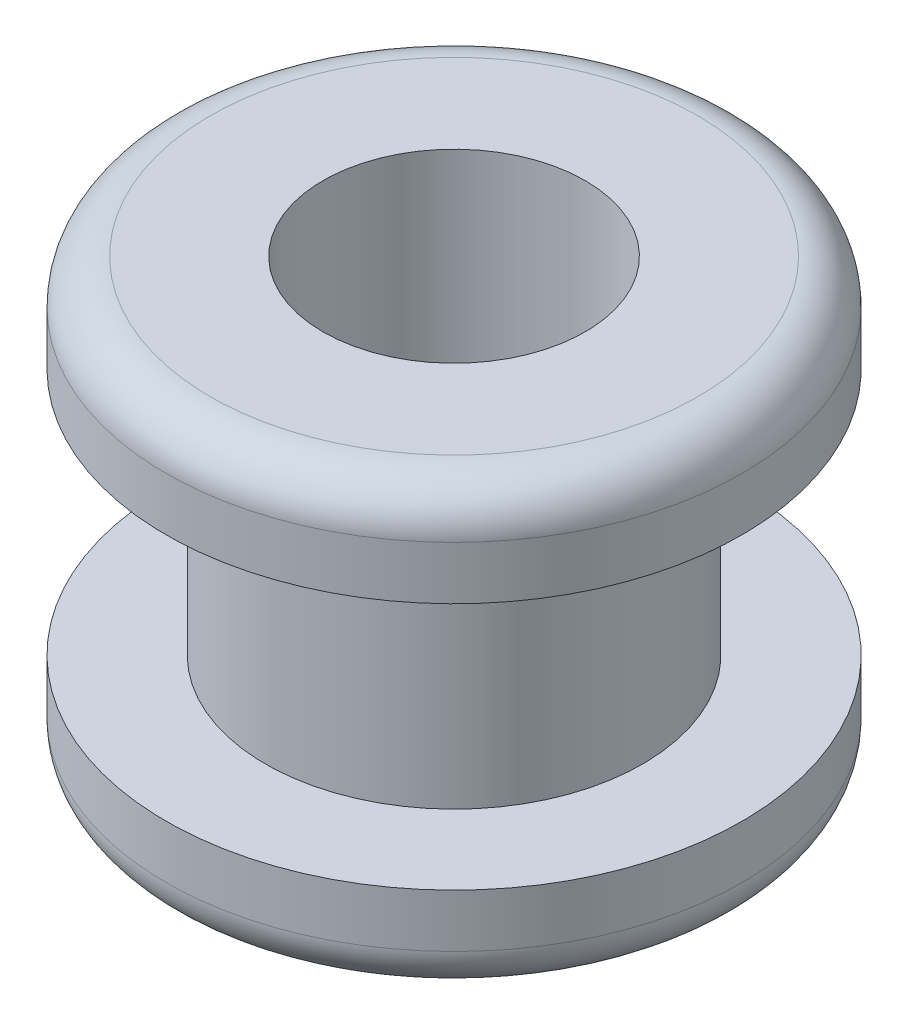
ISO-10303-21;
HEADER;
FILE_DESCRIPTION(('STEP AP214'),'2;1');
FILE_NAME('part.step','',(''),(''),'','','');
FILE_SCHEMA(('AUTOMOTIVE_DESIGN { 1 0 10303 214 1 1 1 1 }'));
ENDSEC;
DATA;
#1=APPLICATION_CONTEXT('core data for automotive mechanical design processes');
#2=APPLICATION_PROTOCOL_DEFINITION('international standard','automotive_design',2000,#1);
#3=PRODUCT_CONTEXT('',#1,'mechanical');
#4=PRODUCT('Part','Part','',(#3));
#5=PRODUCT_RELATED_PRODUCT_CATEGORY('part','',(#4));
#6=PRODUCT_DEFINITION_FORMATION('','',#4);
#7=PRODUCT_DEFINITION_CONTEXT('part definition',#1,'design');
#8=PRODUCT_DEFINITION('design','',#6,#7);
#9=PRODUCT_DEFINITION_SHAPE('','',#8);
#10=(LENGTH_UNIT() NAMED_UNIT(*) SI_UNIT(.MILLI.,.METRE.));
#11=(NAMED_UNIT(*) PLANE_ANGLE_UNIT() SI_UNIT($,.RADIAN.));
#12=(NAMED_UNIT(*) SI_UNIT($,.STERADIAN.) SOLID_ANGLE_UNIT());
#13=UNCERTAINTY_MEASURE_WITH_UNIT(LENGTH_MEASURE(1.E-05),#10,'distance_accuracy_value','');
#14=(GEOMETRIC_REPRESENTATION_CONTEXT(3) GLOBAL_UNCERTAINTY_ASSIGNED_CONTEXT((#13)) GLOBAL_UNIT_ASSIGNED_CONTEXT((#10,
#11,#12)) REPRESENTATION_CONTEXT('',''));
#15=CARTESIAN_POINT('',(0.,0.,0.));
#16=DIRECTION('',(0.,0.,1.));
#17=DIRECTION('',(1.,0.,0.));
#18=AXIS2_PLACEMENT_3D('',#15,#16,#17);
#19=CARTESIAN_POINT('',(0.,0.,0.));
#20=DIRECTION('',(0.,-1.,0.));
#21=DIRECTION('',(0.,0.,-1.));
#22=AXIS2_PLACEMENT_3D('',#19,#20,#21);
#23=CYLINDRICAL_SURFACE('',#22,1.48);
#24=CARTESIAN_POINT('',(0.,2.5,0.));
#25=DIRECTION('',(0.,-1.,0.));
#26=DIRECTION('',(0.,0.,-1.));
#27=AXIS2_PLACEMENT_3D('',#24,#25,#26);
#28=CIRCLE('',#27,1.48);
#29=CARTESIAN_POINT('',(0.,2.5,-1.48));
#30=VERTEX_POINT('',#29);
#31=EDGE_CURVE('E10',#30,#30,#28,.T.);
#32=ORIENTED_EDGE('',*,*,#31,.F.);
#33=EDGE_LOOP('',(#32));
#34=FACE_BOUND('',#33,.T.);
#35=CARTESIAN_POINT('',(0.,-2.5,0.));
#36=DIRECTION('',(0.,-1.,0.));
#37=DIRECTION('',(0.,0.,-1.));
#38=AXIS2_PLACEMENT_3D('',#35,#36,#37);
#39=CIRCLE('',#38,1.48);
#40=CARTESIAN_POINT('',(0.,-2.5,-1.48));
#41=VERTEX_POINT('',#40);
#42=EDGE_CURVE('E71',#41,#41,#39,.T.);
#43=ORIENTED_EDGE('',*,*,#42,.T.);
#44=EDGE_LOOP('',(#43));
#45=FACE_BOUND('',#44,.T.);
#46=ADVANCED_FACE('F37',(#34,#45),#23,.F.);
#47=CARTESIAN_POINT('',(-2.75,2.5,0.));
#48=DIRECTION('',(0.,-1.,0.));
#49=DIRECTION('',(0.,0.,-1.));
#50=AXIS2_PLACEMENT_3D('',#47,#48,#49);
#51=PLANE('',#50);
#52=CARTESIAN_POINT('',(0.,2.5,0.));
#53=DIRECTION('',(0.,-1.,0.));
#54=DIRECTION('',(0.,0.,-1.));
#55=AXIS2_PLACEMENT_3D('',#52,#53,#54);
#56=CIRCLE('',#55,2.75);
#57=CARTESIAN_POINT('',(0.,2.5,-2.75));
#58=VERTEX_POINT('',#57);
#59=EDGE_CURVE('E43',#58,#58,#56,.T.);
#60=ORIENTED_EDGE('',*,*,#59,.F.);
#61=EDGE_LOOP('',(#60));
#62=FACE_BOUND('',#61,.T.);
#63=ORIENTED_EDGE('',*,*,#31,.T.);
#64=EDGE_LOOP('',(#63));
#65=FACE_BOUND('',#64,.T.);
#66=ADVANCED_FACE('F120',(#62,#65),#51,.F.);
#67=CARTESIAN_POINT('',(0.,2.,0.));
#68=DIRECTION('',(0.,-1.,0.));
#69=DIRECTION('',(0.,0.,-1.));
#70=AXIS2_PLACEMENT_3D('',#67,#68,#69);
#71=TOROIDAL_SURFACE('',#70,2.75,0.5);
#72=CARTESIAN_POINT('',(0.,2.,0.));
#73=DIRECTION('',(0.,-1.,0.));
#74=DIRECTION('',(0.,0.,-1.));
#75=AXIS2_PLACEMENT_3D('',#72,#73,#74);
#76=CIRCLE('',#75,3.25);
#77=CARTESIAN_POINT('',(0.,2.,-3.25));
#78=VERTEX_POINT('',#77);
#79=EDGE_CURVE('E47',#78,#78,#76,.T.);
#80=ORIENTED_EDGE('',*,*,#79,.F.);
#81=EDGE_LOOP('',(#80));
#82=FACE_BOUND('',#81,.T.);
#83=ORIENTED_EDGE('',*,*,#59,.T.);
#84=EDGE_LOOP('',(#83));
#85=FACE_BOUND('',#84,.T.);
#86=ADVANCED_FACE('F115',(#82,#85),#71,.T.);
#87=CARTESIAN_POINT('',(0.,0.,0.));
#88=DIRECTION('',(0.,-1.,0.));
#89=DIRECTION('',(0.,0.,-1.));
#90=AXIS2_PLACEMENT_3D('',#87,#88,#89);
#91=CYLINDRICAL_SURFACE('',#90,3.25);
#92=CARTESIAN_POINT('',(0.,1.4,0.));
#93=DIRECTION('',(0.,-1.,0.));
#94=DIRECTION('',(0.,0.,-1.));
#95=AXIS2_PLACEMENT_3D('',#92,#93,#94);
#96=CIRCLE('',#95,3.25);
#97=CARTESIAN_POINT('',(0.,1.4,-3.25));
#98=VERTEX_POINT('',#97);
#99=EDGE_CURVE('E51',#98,#98,#96,.T.);
#100=ORIENTED_EDGE('',*,*,#99,.F.);
#101=EDGE_LOOP('',(#100));
#102=FACE_BOUND('',#101,.T.);
#103=ORIENTED_EDGE('',*,*,#79,.T.);
#104=EDGE_LOOP('',(#103));
#105=FACE_BOUND('',#104,.T.);
#106=ADVANCED_FACE('F109',(#102,#105),#91,.T.);
#107=CARTESIAN_POINT('',(-3.25,1.4,0.));
#108=DIRECTION('',(0.,1.,0.));
#109=DIRECTION('',(0.,0.,1.));
#110=AXIS2_PLACEMENT_3D('',#107,#108,#109);
#111=PLANE('',#110);
#112=CARTESIAN_POINT('',(0.,1.4,0.));
#113=DIRECTION('',(0.,-1.,0.));
#114=DIRECTION('',(0.,0.,-1.));
#115=AXIS2_PLACEMENT_3D('',#112,#113,#114);
#116=CIRCLE('',#115,2.13);
#117=CARTESIAN_POINT('',(0.,1.4,-2.13));
#118=VERTEX_POINT('',#117);
#119=EDGE_CURVE('E56',#118,#118,#116,.T.);
#120=ORIENTED_EDGE('',*,*,#119,.F.);
#121=EDGE_LOOP('',(#120));
#122=FACE_BOUND('',#121,.T.);
#123=ORIENTED_EDGE('',*,*,#99,.T.);
#124=EDGE_LOOP('',(#123));
#125=FACE_BOUND('',#124,.T.);
#126=ADVANCED_FACE('F103',(#122,#125),#111,.F.);
#127=CARTESIAN_POINT('',(0.,0.,0.));
#128=DIRECTION('',(0.,-1.,0.));
#129=DIRECTION('',(0.,0.,-1.));
#130=AXIS2_PLACEMENT_3D('',#127,#128,#129);
#131=CYLINDRICAL_SURFACE('',#130,2.13);
#132=CARTESIAN_POINT('',(0.,-1.4,0.));
#133=DIRECTION('',(0.,-1.,0.));
#134=DIRECTION('',(0.,0.,-1.));
#135=AXIS2_PLACEMENT_3D('',#132,#133,#134);
#136=CIRCLE('',#135,2.13);
#137=CARTESIAN_POINT('',(0.,-1.4,-2.13));
#138=VERTEX_POINT('',#137);
#139=EDGE_CURVE('E59',#138,#138,#136,.T.);
#140=ORIENTED_EDGE('',*,*,#139,.F.);
#141=EDGE_LOOP('',(#140));
#142=FACE_BOUND('',#141,.T.);
#143=ORIENTED_EDGE('',*,*,#119,.T.);
#144=EDGE_LOOP('',(#143));
#145=FACE_BOUND('',#144,.T.);
#146=ADVANCED_FACE('F97',(#142,#145),#131,.T.);
#147=CARTESIAN_POINT('',(-3.25,-1.4,0.));
#148=DIRECTION('',(0.,-1.,0.));
#149=DIRECTION('',(0.,0.,-1.));
#150=AXIS2_PLACEMENT_3D('',#147,#148,#149);
#151=PLANE('',#150);
#152=CARTESIAN_POINT('',(0.,-1.4,0.));
#153=DIRECTION('',(0.,-1.,0.));
#154=DIRECTION('',(0.,0.,-1.));
#155=AXIS2_PLACEMENT_3D('',#152,#153,#154);
#156=CIRCLE('',#155,3.25);
#157=CARTESIAN_POINT('',(0.,-1.4,-3.25));
#158=VERTEX_POINT('',#157);
#159=EDGE_CURVE('E62',#158,#158,#156,.T.);
#160=ORIENTED_EDGE('',*,*,#159,.F.);
#161=EDGE_LOOP('',(#160));
#162=FACE_BOUND('',#161,.T.);
#163=ORIENTED_EDGE('',*,*,#139,.T.);
#164=EDGE_LOOP('',(#163));
#165=FACE_BOUND('',#164,.T.);
#166=ADVANCED_FACE('F91',(#162,#165),#151,.F.);
#167=CARTESIAN_POINT('',(0.,0.,0.));
#168=DIRECTION('',(0.,-1.,0.));
#169=DIRECTION('',(0.,0.,-1.));
#170=AXIS2_PLACEMENT_3D('',#167,#168,#169);
#171=CYLINDRICAL_SURFACE('',#170,3.25);
#172=CARTESIAN_POINT('',(0.,-2.,0.));
#173=DIRECTION('',(0.,-1.,0.));
#174=DIRECTION('',(0.,0.,-1.));
#175=AXIS2_PLACEMENT_3D('',#172,#173,#174);
#176=CIRCLE('',#175,3.25);
#177=CARTESIAN_POINT('',(0.,-2.,-3.25));
#178=VERTEX_POINT('',#177);
#179=EDGE_CURVE('E65',#178,#178,#176,.T.);
#180=ORIENTED_EDGE('',*,*,#179,.F.);
#181=EDGE_LOOP('',(#180));
#182=FACE_BOUND('',#181,.T.);
#183=ORIENTED_EDGE('',*,*,#159,.T.);
#184=EDGE_LOOP('',(#183));
#185=FACE_BOUND('',#184,.T.);
#186=ADVANCED_FACE('F85',(#182,#185),#171,.T.);
#187=CARTESIAN_POINT('',(0.,-2.,0.));
#188=DIRECTION('',(0.,-1.,0.));
#189=DIRECTION('',(0.,0.,-1.));
#190=AXIS2_PLACEMENT_3D('',#187,#188,#189);
#191=TOROIDAL_SURFACE('',#190,2.75,0.5);
#192=CARTESIAN_POINT('',(0.,-2.5,0.));
#193=DIRECTION('',(0.,-1.,0.));
#194=DIRECTION('',(0.,0.,-1.));
#195=AXIS2_PLACEMENT_3D('',#192,#193,#194);
#196=CIRCLE('',#195,2.75);
#197=CARTESIAN_POINT('',(0.,-2.5,-2.75));
#198=VERTEX_POINT('',#197);
#199=EDGE_CURVE('E68',#198,#198,#196,.T.);
#200=ORIENTED_EDGE('',*,*,#199,.F.);
#201=EDGE_LOOP('',(#200));
#202=FACE_BOUND('',#201,.T.);
#203=ORIENTED_EDGE('',*,*,#179,.T.);
#204=EDGE_LOOP('',(#203));
#205=FACE_BOUND('',#204,.T.);
#206=ADVANCED_FACE('F79',(#202,#205),#191,.T.);
#207=CARTESIAN_POINT('',(-2.75,-2.5,0.));
#208=DIRECTION('',(0.,1.,0.));
#209=DIRECTION('',(0.,0.,1.));
#210=AXIS2_PLACEMENT_3D('',#207,#208,#209);
#211=PLANE('',#210);
#212=ORIENTED_EDGE('',*,*,#42,.F.);
#213=EDGE_LOOP('',(#212));
#214=FACE_BOUND('',#213,.T.);
#215=ORIENTED_EDGE('',*,*,#199,.T.);
#216=EDGE_LOOP('',(#215));
#217=FACE_BOUND('',#216,.T.);
#218=ADVANCED_FACE('F76',(#214,#217),#211,.F.);
#219=CLOSED_SHELL('',(#46,#66,#86,#106,#126,#146,#166,#186,#206,#218));
#220=MANIFOLD_SOLID_BREP('B2',#219);
#221=ADVANCED_BREP_SHAPE_REPRESENTATION('',(#18,#220),#14);
#222=SHAPE_DEFINITION_REPRESENTATION(#9,#221);
ENDSEC;
END-ISO-10303-21;
